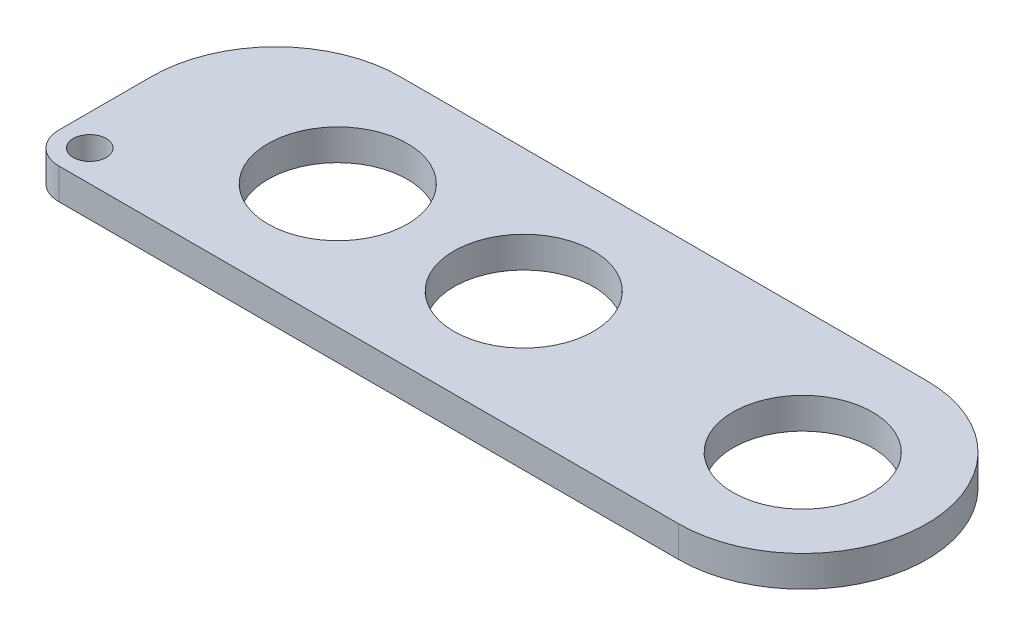
ISO-10303-21;
HEADER;
FILE_DESCRIPTION(('STEP AP214'),'2;1');
FILE_NAME('part.step','',(''),(''),'','','');
FILE_SCHEMA(('AUTOMOTIVE_DESIGN { 1 0 10303 214 1 1 1 1 }'));
ENDSEC;
DATA;
#1=APPLICATION_CONTEXT('core data for automotive mechanical design processes');
#2=APPLICATION_PROTOCOL_DEFINITION('international standard','automotive_design',2000,#1);
#3=PRODUCT_CONTEXT('',#1,'mechanical');
#4=PRODUCT('Part','Part','',(#3));
#5=PRODUCT_RELATED_PRODUCT_CATEGORY('part','',(#4));
#6=PRODUCT_DEFINITION_FORMATION('','',#4);
#7=PRODUCT_DEFINITION_CONTEXT('part definition',#1,'design');
#8=PRODUCT_DEFINITION('design','',#6,#7);
#9=PRODUCT_DEFINITION_SHAPE('','',#8);
#10=(LENGTH_UNIT() NAMED_UNIT(*) SI_UNIT(.MILLI.,.METRE.));
#11=(NAMED_UNIT(*) PLANE_ANGLE_UNIT() SI_UNIT($,.RADIAN.));
#12=(NAMED_UNIT(*) SI_UNIT($,.STERADIAN.) SOLID_ANGLE_UNIT());
#13=UNCERTAINTY_MEASURE_WITH_UNIT(LENGTH_MEASURE(1.E-05),#10,'distance_accuracy_value','');
#14=(GEOMETRIC_REPRESENTATION_CONTEXT(3) GLOBAL_UNCERTAINTY_ASSIGNED_CONTEXT((#13)) GLOBAL_UNIT_ASSIGNED_CONTEXT((#10,
#11,#12)) REPRESENTATION_CONTEXT('',''));
#15=CARTESIAN_POINT('',(0.,0.,0.));
#16=DIRECTION('',(0.,0.,1.));
#17=DIRECTION('',(1.,0.,0.));
#18=AXIS2_PLACEMENT_3D('',#15,#16,#17);
#19=CARTESIAN_POINT('',(-38.1,6.35,-25.4));
#20=DIRECTION('',(1.,0.,0.));
#21=DIRECTION('',(0.,0.,-1.));
#22=AXIS2_PLACEMENT_3D('',#19,#20,#21);
#23=PLANE('',#22);
#24=DIRECTION('',(0.,0.,1.));
#25=VECTOR('',#24,1.);
#26=CARTESIAN_POINT('',(-38.1,6.35,-25.4));
#27=LINE('',#26,#25);
#28=CARTESIAN_POINT('',(-38.1,6.35,0.));
#29=VERTEX_POINT('',#28);
#30=CARTESIAN_POINT('',(-38.1,6.35,19.05));
#31=VERTEX_POINT('',#30);
#32=EDGE_CURVE('E110',#29,#31,#27,.T.);
#33=ORIENTED_EDGE('',*,*,#32,.F.);
#34=DIRECTION('',(0.,-1.,0.));
#35=VECTOR('',#34,1.);
#36=CARTESIAN_POINT('',(-38.1,0.,0.));
#37=LINE('',#36,#35);
#38=CARTESIAN_POINT('',(-38.1,0.,0.));
#39=VERTEX_POINT('',#38);
#40=EDGE_CURVE('E133',#29,#39,#37,.T.);
#41=ORIENTED_EDGE('',*,*,#40,.T.);
#42=DIRECTION('',(0.,0.,1.));
#43=VECTOR('',#42,1.);
#44=CARTESIAN_POINT('',(-38.1,0.,-25.4));
#45=LINE('',#44,#43);
#46=CARTESIAN_POINT('',(-38.1,0.,19.05));
#47=VERTEX_POINT('',#46);
#48=EDGE_CURVE('E117',#39,#47,#45,.T.);
#49=ORIENTED_EDGE('',*,*,#48,.T.);
#50=DIRECTION('',(0.,-1.,0.));
#51=VECTOR('',#50,1.);
#52=CARTESIAN_POINT('',(-38.1,6.35,19.05));
#53=LINE('',#52,#51);
#54=EDGE_CURVE('E129',#47,#31,#53,.F.);
#55=ORIENTED_EDGE('',*,*,#54,.T.);
#56=EDGE_LOOP('',(#33,#41,#49,#55));
#57=FACE_BOUND('',#56,.T.);
#58=ADVANCED_FACE('F33',(#57),#23,.F.);
#59=CARTESIAN_POINT('',(95.25,6.35,25.4));
#60=DIRECTION('',(0.,0.,1.));
#61=DIRECTION('',(1.,0.,0.));
#62=AXIS2_PLACEMENT_3D('',#59,#60,#61);
#63=PLANE('',#62);
#64=DIRECTION('',(-1.,0.,0.));
#65=VECTOR('',#64,1.);
#66=CARTESIAN_POINT('',(95.25,6.35,25.4));
#67=LINE('',#66,#65);
#68=CARTESIAN_POINT('',(95.25,6.35,25.4));
#69=VERTEX_POINT('',#68);
#70=CARTESIAN_POINT('',(-31.75,6.35,25.4));
#71=VERTEX_POINT('',#70);
#72=EDGE_CURVE('E89',#69,#71,#67,.T.);
#73=ORIENTED_EDGE('',*,*,#72,.T.);
#74=DIRECTION('',(0.,-1.,0.));
#75=VECTOR('',#74,1.);
#76=CARTESIAN_POINT('',(-31.75,0.,25.4));
#77=LINE('',#76,#75);
#78=CARTESIAN_POINT('',(-31.75,0.,25.4));
#79=VERTEX_POINT('',#78);
#80=EDGE_CURVE('E96',#71,#79,#77,.T.);
#81=ORIENTED_EDGE('',*,*,#80,.T.);
#82=DIRECTION('',(-1.,0.,0.));
#83=VECTOR('',#82,1.);
#84=CARTESIAN_POINT('',(95.25,0.,25.4));
#85=LINE('',#84,#83);
#86=CARTESIAN_POINT('',(95.25,0.,25.4));
#87=VERTEX_POINT('',#86);
#88=EDGE_CURVE('E92',#87,#79,#85,.T.);
#89=ORIENTED_EDGE('',*,*,#88,.F.);
#90=DIRECTION('',(0.,-1.,0.));
#91=VECTOR('',#90,1.);
#92=CARTESIAN_POINT('',(95.25,6.35,25.4));
#93=LINE('',#92,#91);
#94=EDGE_CURVE('E84',#69,#87,#93,.T.);
#95=ORIENTED_EDGE('',*,*,#94,.F.);
#96=EDGE_LOOP('',(#73,#81,#89,#95));
#97=FACE_BOUND('',#96,.T.);
#98=ADVANCED_FACE('F86',(#97),#63,.T.);
#99=CARTESIAN_POINT('',(95.25,6.35,0.));
#100=DIRECTION('',(0.,-1.,0.));
#101=DIRECTION('',(0.,0.,-1.));
#102=AXIS2_PLACEMENT_3D('',#99,#100,#101);
#103=CYLINDRICAL_SURFACE('',#102,25.4);
#104=CARTESIAN_POINT('',(95.25,0.,0.));
#105=DIRECTION('',(0.,1.,0.));
#106=DIRECTION('',(0.,0.,1.));
#107=AXIS2_PLACEMENT_3D('',#104,#105,#106);
#108=CIRCLE('',#107,25.4);
#109=CARTESIAN_POINT('',(95.25,0.,-25.4));
#110=VERTEX_POINT('',#109);
#111=EDGE_CURVE('E121',#87,#110,#108,.T.);
#112=ORIENTED_EDGE('',*,*,#111,.T.);
#113=DIRECTION('',(0.,-1.,0.));
#114=VECTOR('',#113,1.);
#115=CARTESIAN_POINT('',(95.25,6.35,-25.4));
#116=LINE('',#115,#114);
#117=CARTESIAN_POINT('',(95.25,6.35,-25.4));
#118=VERTEX_POINT('',#117);
#119=EDGE_CURVE('E97',#118,#110,#116,.T.);
#120=ORIENTED_EDGE('',*,*,#119,.F.);
#121=CARTESIAN_POINT('',(95.25,6.35,0.));
#122=DIRECTION('',(0.,1.,0.));
#123=DIRECTION('',(0.,0.,1.));
#124=AXIS2_PLACEMENT_3D('',#121,#122,#123);
#125=CIRCLE('',#124,25.4);
#126=EDGE_CURVE('E101',#69,#118,#125,.T.);
#127=ORIENTED_EDGE('',*,*,#126,.F.);
#128=ORIENTED_EDGE('',*,*,#94,.T.);
#129=EDGE_LOOP('',(#112,#120,#127,#128));
#130=FACE_BOUND('',#129,.T.);
#131=ADVANCED_FACE('F102',(#130),#103,.T.);
#132=CARTESIAN_POINT('',(-38.1,6.35,-25.4));
#133=DIRECTION('',(0.,0.,-1.));
#134=DIRECTION('',(-1.,0.,0.));
#135=AXIS2_PLACEMENT_3D('',#132,#133,#134);
#136=PLANE('',#135);
#137=DIRECTION('',(1.,0.,0.));
#138=VECTOR('',#137,1.);
#139=CARTESIAN_POINT('',(-38.1,0.,-25.4));
#140=LINE('',#139,#138);
#141=CARTESIAN_POINT('',(-12.7,0.,-25.4));
#142=VERTEX_POINT('',#141);
#143=EDGE_CURVE('E112',#142,#110,#140,.T.);
#144=ORIENTED_EDGE('',*,*,#143,.F.);
#145=DIRECTION('',(0.,-1.,0.));
#146=VECTOR('',#145,1.);
#147=CARTESIAN_POINT('',(-12.7,6.35,-25.4));
#148=LINE('',#147,#146);
#149=CARTESIAN_POINT('',(-12.7,6.35,-25.4));
#150=VERTEX_POINT('',#149);
#151=EDGE_CURVE('E41',#142,#150,#148,.F.);
#152=ORIENTED_EDGE('',*,*,#151,.T.);
#153=DIRECTION('',(1.,0.,0.));
#154=VECTOR('',#153,1.);
#155=CARTESIAN_POINT('',(-38.1,6.35,-25.4));
#156=LINE('',#155,#154);
#157=EDGE_CURVE('E105',#150,#118,#156,.T.);
#158=ORIENTED_EDGE('',*,*,#157,.T.);
#159=ORIENTED_EDGE('',*,*,#119,.T.);
#160=EDGE_LOOP('',(#144,#152,#158,#159));
#161=FACE_BOUND('',#160,.T.);
#162=ADVANCED_FACE('F163',(#161),#136,.T.);
#163=CARTESIAN_POINT('',(95.25,6.35,0.));
#164=DIRECTION('',(0.,1.,0.));
#165=DIRECTION('',(0.,0.,1.));
#166=AXIS2_PLACEMENT_3D('',#163,#164,#165);
#167=PLANE('',#166);
#168=CARTESIAN_POINT('',(-31.75,6.35,19.05));
#169=DIRECTION('',(0.,1.,0.));
#170=DIRECTION('',(0.,0.,1.));
#171=AXIS2_PLACEMENT_3D('',#168,#169,#170);
#172=CIRCLE('',#171,3.3782);
#173=CARTESIAN_POINT('',(-31.75,6.35,22.4282));
#174=VERTEX_POINT('',#173);
#175=EDGE_CURVE('E209',#174,#174,#172,.T.);
#176=ORIENTED_EDGE('',*,*,#175,.F.);
#177=EDGE_LOOP('',(#176));
#178=FACE_BOUND('',#177,.T.);
#179=CARTESIAN_POINT('',(0.,6.35,0.));
#180=DIRECTION('',(0.,1.,0.));
#181=DIRECTION('',(0.,0.,1.));
#182=AXIS2_PLACEMENT_3D('',#179,#180,#181);
#183=CIRCLE('',#182,14.2875);
#184=CARTESIAN_POINT('',(0.,6.35,14.2875));
#185=VERTEX_POINT('',#184);
#186=EDGE_CURVE('E189',#185,#185,#183,.T.);
#187=ORIENTED_EDGE('',*,*,#186,.F.);
#188=EDGE_LOOP('',(#187));
#189=FACE_BOUND('',#188,.T.);
#190=CARTESIAN_POINT('',(38.1,6.35,0.));
#191=DIRECTION('',(0.,1.,0.));
#192=DIRECTION('',(0.,0.,1.));
#193=AXIS2_PLACEMENT_3D('',#190,#191,#192);
#194=CIRCLE('',#193,14.2875);
#195=CARTESIAN_POINT('',(38.1,6.35,14.2875));
#196=VERTEX_POINT('',#195);
#197=EDGE_CURVE('E191',#196,#196,#194,.T.);
#198=ORIENTED_EDGE('',*,*,#197,.F.);
#199=EDGE_LOOP('',(#198));
#200=FACE_BOUND('',#199,.T.);
#201=CARTESIAN_POINT('',(95.25,6.35,0.));
#202=DIRECTION('',(0.,1.,0.));
#203=DIRECTION('',(0.,0.,1.));
#204=AXIS2_PLACEMENT_3D('',#201,#202,#203);
#205=CIRCLE('',#204,14.2875);
#206=CARTESIAN_POINT('',(95.25,6.35,14.2875));
#207=VERTEX_POINT('',#206);
#208=EDGE_CURVE('E201',#207,#207,#205,.T.);
#209=ORIENTED_EDGE('',*,*,#208,.F.);
#210=EDGE_LOOP('',(#209));
#211=FACE_BOUND('',#210,.T.);
#212=ORIENTED_EDGE('',*,*,#157,.F.);
#213=CARTESIAN_POINT('',(-12.7,6.35,0.));
#214=DIRECTION('',(0.,1.,0.));
#215=DIRECTION('',(0.,0.,1.));
#216=AXIS2_PLACEMENT_3D('',#213,#214,#215);
#217=CIRCLE('',#216,25.4);
#218=EDGE_CURVE('E11',#150,#29,#217,.T.);
#219=ORIENTED_EDGE('',*,*,#218,.T.);
#220=ORIENTED_EDGE('',*,*,#32,.T.);
#221=CARTESIAN_POINT('',(-31.75,6.35,19.05));
#222=DIRECTION('',(0.,1.,0.));
#223=DIRECTION('',(0.,0.,1.));
#224=AXIS2_PLACEMENT_3D('',#221,#222,#223);
#225=CIRCLE('',#224,6.35);
#226=EDGE_CURVE('E109',#31,#71,#225,.T.);
#227=ORIENTED_EDGE('',*,*,#226,.T.);
#228=ORIENTED_EDGE('',*,*,#72,.F.);
#229=ORIENTED_EDGE('',*,*,#126,.T.);
#230=EDGE_LOOP('',(#212,#219,#220,#227,#228,#229));
#231=FACE_BOUND('',#230,.T.);
#232=ADVANCED_FACE('F107',(#178,#189,#200,#211,#231),#167,.T.);
#233=CARTESIAN_POINT('',(95.25,0.,0.));
#234=DIRECTION('',(0.,1.,0.));
#235=DIRECTION('',(0.,0.,1.));
#236=AXIS2_PLACEMENT_3D('',#233,#234,#235);
#237=PLANE('',#236);
#238=CARTESIAN_POINT('',(-31.75,0.,19.05));
#239=DIRECTION('',(0.,1.,0.));
#240=DIRECTION('',(0.,0.,1.));
#241=AXIS2_PLACEMENT_3D('',#238,#239,#240);
#242=CIRCLE('',#241,3.3782);
#243=CARTESIAN_POINT('',(-31.75,0.,22.4282));
#244=VERTEX_POINT('',#243);
#245=EDGE_CURVE('E205',#244,#244,#242,.T.);
#246=ORIENTED_EDGE('',*,*,#245,.T.);
#247=EDGE_LOOP('',(#246));
#248=FACE_BOUND('',#247,.T.);
#249=CARTESIAN_POINT('',(0.,0.,0.));
#250=DIRECTION('',(0.,1.,0.));
#251=DIRECTION('',(0.,0.,1.));
#252=AXIS2_PLACEMENT_3D('',#249,#250,#251);
#253=CIRCLE('',#252,14.2875);
#254=CARTESIAN_POINT('',(0.,0.,14.2875));
#255=VERTEX_POINT('',#254);
#256=EDGE_CURVE('E119',#255,#255,#253,.T.);
#257=ORIENTED_EDGE('',*,*,#256,.T.);
#258=EDGE_LOOP('',(#257));
#259=FACE_BOUND('',#258,.T.);
#260=CARTESIAN_POINT('',(38.1,0.,0.));
#261=DIRECTION('',(0.,1.,0.));
#262=DIRECTION('',(0.,0.,1.));
#263=AXIS2_PLACEMENT_3D('',#260,#261,#262);
#264=CIRCLE('',#263,14.2875);
#265=CARTESIAN_POINT('',(38.1,0.,14.2875));
#266=VERTEX_POINT('',#265);
#267=EDGE_CURVE('E195',#266,#266,#264,.T.);
#268=ORIENTED_EDGE('',*,*,#267,.T.);
#269=EDGE_LOOP('',(#268));
#270=FACE_BOUND('',#269,.T.);
#271=CARTESIAN_POINT('',(95.25,0.,0.));
#272=DIRECTION('',(0.,1.,0.));
#273=DIRECTION('',(0.,0.,1.));
#274=AXIS2_PLACEMENT_3D('',#271,#272,#273);
#275=CIRCLE('',#274,14.2875);
#276=CARTESIAN_POINT('',(95.25,0.,14.2875));
#277=VERTEX_POINT('',#276);
#278=EDGE_CURVE('E203',#277,#277,#275,.T.);
#279=ORIENTED_EDGE('',*,*,#278,.T.);
#280=EDGE_LOOP('',(#279));
#281=FACE_BOUND('',#280,.T.);
#282=ORIENTED_EDGE('',*,*,#48,.F.);
#283=CARTESIAN_POINT('',(-12.7,0.,0.));
#284=DIRECTION('',(0.,1.,0.));
#285=DIRECTION('',(0.,0.,1.));
#286=AXIS2_PLACEMENT_3D('',#283,#284,#285);
#287=CIRCLE('',#286,25.4);
#288=EDGE_CURVE('E55',#39,#142,#287,.F.);
#289=ORIENTED_EDGE('',*,*,#288,.T.);
#290=ORIENTED_EDGE('',*,*,#143,.T.);
#291=ORIENTED_EDGE('',*,*,#111,.F.);
#292=ORIENTED_EDGE('',*,*,#88,.T.);
#293=CARTESIAN_POINT('',(-31.75,0.,19.05));
#294=DIRECTION('',(0.,1.,0.));
#295=DIRECTION('',(0.,0.,1.));
#296=AXIS2_PLACEMENT_3D('',#293,#294,#295);
#297=CIRCLE('',#296,6.35);
#298=EDGE_CURVE('E126',#79,#47,#297,.F.);
#299=ORIENTED_EDGE('',*,*,#298,.T.);
#300=EDGE_LOOP('',(#282,#289,#290,#291,#292,#299));
#301=FACE_BOUND('',#300,.T.);
#302=ADVANCED_FACE('F141',(#248,#259,#270,#281,#301),#237,.F.);
#303=CARTESIAN_POINT('',(95.25,0.,0.));
#304=DIRECTION('',(0.,1.,0.));
#305=DIRECTION('',(0.,0.,1.));
#306=AXIS2_PLACEMENT_3D('',#303,#304,#305);
#307=CYLINDRICAL_SURFACE('',#306,14.2875);
#308=ORIENTED_EDGE('',*,*,#278,.F.);
#309=EDGE_LOOP('',(#308));
#310=FACE_BOUND('',#309,.T.);
#311=ORIENTED_EDGE('',*,*,#208,.T.);
#312=EDGE_LOOP('',(#311));
#313=FACE_BOUND('',#312,.T.);
#314=ADVANCED_FACE('F168',(#310,#313),#307,.F.);
#315=CARTESIAN_POINT('',(38.1,0.,0.));
#316=DIRECTION('',(0.,1.,0.));
#317=DIRECTION('',(0.,0.,1.));
#318=AXIS2_PLACEMENT_3D('',#315,#316,#317);
#319=CYLINDRICAL_SURFACE('',#318,14.2875);
#320=ORIENTED_EDGE('',*,*,#267,.F.);
#321=EDGE_LOOP('',(#320));
#322=FACE_BOUND('',#321,.T.);
#323=ORIENTED_EDGE('',*,*,#197,.T.);
#324=EDGE_LOOP('',(#323));
#325=FACE_BOUND('',#324,.T.);
#326=ADVANCED_FACE('F175',(#322,#325),#319,.F.);
#327=CARTESIAN_POINT('',(0.,0.,0.));
#328=DIRECTION('',(0.,1.,0.));
#329=DIRECTION('',(0.,0.,1.));
#330=AXIS2_PLACEMENT_3D('',#327,#328,#329);
#331=CYLINDRICAL_SURFACE('',#330,14.2875);
#332=ORIENTED_EDGE('',*,*,#256,.F.);
#333=EDGE_LOOP('',(#332));
#334=FACE_BOUND('',#333,.T.);
#335=ORIENTED_EDGE('',*,*,#186,.T.);
#336=EDGE_LOOP('',(#335));
#337=FACE_BOUND('',#336,.T.);
#338=ADVANCED_FACE('F151',(#334,#337),#331,.F.);
#339=CARTESIAN_POINT('',(-31.75,6.35,19.05));
#340=DIRECTION('',(0.,1.,0.));
#341=DIRECTION('',(0.,0.,1.));
#342=AXIS2_PLACEMENT_3D('',#339,#340,#341);
#343=CYLINDRICAL_SURFACE('',#342,3.3782);
#344=ORIENTED_EDGE('',*,*,#245,.F.);
#345=EDGE_LOOP('',(#344));
#346=FACE_BOUND('',#345,.T.);
#347=ORIENTED_EDGE('',*,*,#175,.T.);
#348=EDGE_LOOP('',(#347));
#349=FACE_BOUND('',#348,.T.);
#350=ADVANCED_FACE('F146',(#346,#349),#343,.F.);
#351=CARTESIAN_POINT('',(-31.75,6.35,19.05));
#352=DIRECTION('',(0.,1.,0.));
#353=DIRECTION('',(0.,0.,1.));
#354=AXIS2_PLACEMENT_3D('',#351,#352,#353);
#355=CYLINDRICAL_SURFACE('',#354,6.35);
#356=ORIENTED_EDGE('',*,*,#226,.F.);
#357=ORIENTED_EDGE('',*,*,#54,.F.);
#358=ORIENTED_EDGE('',*,*,#298,.F.);
#359=ORIENTED_EDGE('',*,*,#80,.F.);
#360=EDGE_LOOP('',(#356,#357,#358,#359));
#361=FACE_BOUND('',#360,.T.);
#362=ADVANCED_FACE('F144',(#361),#355,.T.);
#363=CARTESIAN_POINT('',(-12.7,6.35,0.));
#364=DIRECTION('',(0.,1.,0.));
#365=DIRECTION('',(0.,0.,1.));
#366=AXIS2_PLACEMENT_3D('',#363,#364,#365);
#367=CYLINDRICAL_SURFACE('',#366,25.4);
#368=ORIENTED_EDGE('',*,*,#218,.F.);
#369=ORIENTED_EDGE('',*,*,#151,.F.);
#370=ORIENTED_EDGE('',*,*,#288,.F.);
#371=ORIENTED_EDGE('',*,*,#40,.F.);
#372=EDGE_LOOP('',(#368,#369,#370,#371));
#373=FACE_BOUND('',#372,.T.);
#374=ADVANCED_FACE('F35',(#373),#367,.T.);
#375=CLOSED_SHELL('',(#58,#98,#131,#162,#232,#302,#314,#326,#338,#350,#362,#374));
#376=MANIFOLD_SOLID_BREP('B2',#375);
#377=ADVANCED_BREP_SHAPE_REPRESENTATION('',(#18,#376),#14);
#378=SHAPE_DEFINITION_REPRESENTATION(#9,#377);
ENDSEC;
END-ISO-10303-21;
